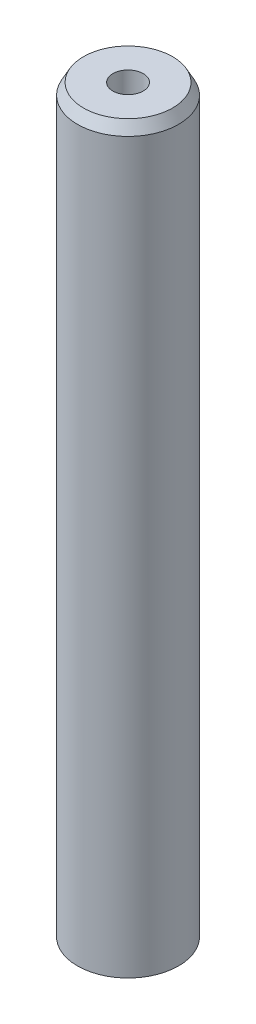
ISO-10303-21;
HEADER;
FILE_DESCRIPTION(('STEP AP214'),'2;1');
FILE_NAME('part.step','',(''),(''),'','','');
FILE_SCHEMA(('AUTOMOTIVE_DESIGN { 1 0 10303 214 1 1 1 1 }'));
ENDSEC;
DATA;
#1=APPLICATION_CONTEXT('core data for automotive mechanical design processes');
#2=APPLICATION_PROTOCOL_DEFINITION('international standard','automotive_design',2000,#1);
#3=PRODUCT_CONTEXT('',#1,'mechanical');
#4=PRODUCT('Part','Part','',(#3));
#5=PRODUCT_RELATED_PRODUCT_CATEGORY('part','',(#4));
#6=PRODUCT_DEFINITION_FORMATION('','',#4);
#7=PRODUCT_DEFINITION_CONTEXT('part definition',#1,'design');
#8=PRODUCT_DEFINITION('design','',#6,#7);
#9=PRODUCT_DEFINITION_SHAPE('','',#8);
#10=(LENGTH_UNIT() NAMED_UNIT(*) SI_UNIT(.MILLI.,.METRE.));
#11=(NAMED_UNIT(*) PLANE_ANGLE_UNIT() SI_UNIT($,.RADIAN.));
#12=(NAMED_UNIT(*) SI_UNIT($,.STERADIAN.) SOLID_ANGLE_UNIT());
#13=UNCERTAINTY_MEASURE_WITH_UNIT(LENGTH_MEASURE(1.E-05),#10,'distance_accuracy_value','');
#14=(GEOMETRIC_REPRESENTATION_CONTEXT(3) GLOBAL_UNCERTAINTY_ASSIGNED_CONTEXT((#13)) GLOBAL_UNIT_ASSIGNED_CONTEXT((#10,
#11,#12)) REPRESENTATION_CONTEXT('',''));
#15=CARTESIAN_POINT('',(0.,0.,0.));
#16=DIRECTION('',(0.,0.,1.));
#17=DIRECTION('',(1.,0.,0.));
#18=AXIS2_PLACEMENT_3D('',#15,#16,#17);
#19=CARTESIAN_POINT('',(0.,73.7592737962187,0.));
#20=DIRECTION('',(0.,-1.,0.));
#21=DIRECTION('',(0.,0.,-1.));
#22=AXIS2_PLACEMENT_3D('',#19,#20,#21);
#23=CYLINDRICAL_SURFACE('',#22,5.);
#24=CARTESIAN_POINT('',(0.,72.6596073131407,0.));
#25=DIRECTION('',(0.,1.,0.));
#26=DIRECTION('',(0.,0.,1.));
#27=AXIS2_PLACEMENT_3D('',#24,#25,#26);
#28=CIRCLE('',#27,5.);
#29=CARTESIAN_POINT('',(0.,72.6596073131407,-5.));
#30=VERTEX_POINT('',#29);
#31=EDGE_CURVE('E50',#30,#30,#28,.F.);
#32=ORIENTED_EDGE('',*,*,#31,.T.);
#33=EDGE_LOOP('',(#32));
#34=FACE_BOUND('',#33,.T.);
#35=CARTESIAN_POINT('',(0.,0.596093347788318,0.));
#36=DIRECTION('',(0.,1.,0.));
#37=DIRECTION('',(0.,0.,1.));
#38=AXIS2_PLACEMENT_3D('',#35,#36,#37);
#39=CIRCLE('',#38,5.);
#40=CARTESIAN_POINT('',(0.,0.596093347788318,5.));
#41=VERTEX_POINT('',#40);
#42=EDGE_CURVE('E51',#41,#41,#39,.T.);
#43=ORIENTED_EDGE('',*,*,#42,.T.);
#44=EDGE_LOOP('',(#43));
#45=FACE_BOUND('',#44,.T.);
#46=ADVANCED_FACE('F39',(#34,#45),#23,.T.);
#47=CARTESIAN_POINT('',(0.,73.7592737962187,0.));
#48=DIRECTION('',(0.,1.,0.));
#49=DIRECTION('',(0.,0.,1.));
#50=AXIS2_PLACEMENT_3D('',#47,#48,#49);
#51=PLANE('',#50);
#52=CARTESIAN_POINT('',(0.,73.7592737962187,0.));
#53=DIRECTION('',(0.,1.,0.));
#54=DIRECTION('',(0.,0.,1.));
#55=AXIS2_PLACEMENT_3D('',#52,#53,#54);
#56=CIRCLE('',#55,4.40390665221171);
#57=CARTESIAN_POINT('',(0.,73.7592737962187,-4.40390665221171));
#58=VERTEX_POINT('',#57);
#59=EDGE_CURVE('E54',#58,#58,#56,.T.);
#60=ORIENTED_EDGE('',*,*,#59,.T.);
#61=EDGE_LOOP('',(#60));
#62=FACE_BOUND('',#61,.T.);
#63=CARTESIAN_POINT('',(0.,73.7592737962187,0.));
#64=DIRECTION('',(0.,1.,0.));
#65=DIRECTION('',(0.,0.,1.));
#66=AXIS2_PLACEMENT_3D('',#63,#64,#65);
#67=CIRCLE('',#66,1.49879697790066);
#68=CARTESIAN_POINT('',(0.,73.7592737962187,1.49879697790066));
#69=VERTEX_POINT('',#68);
#70=EDGE_CURVE('E58',#69,#69,#67,.T.);
#71=ORIENTED_EDGE('',*,*,#70,.F.);
#72=EDGE_LOOP('',(#71));
#73=FACE_BOUND('',#72,.T.);
#74=ADVANCED_FACE('F69',(#62,#73),#51,.T.);
#75=CARTESIAN_POINT('',(0.,0.,0.));
#76=DIRECTION('',(0.,1.,0.));
#77=DIRECTION('',(0.,0.,1.));
#78=AXIS2_PLACEMENT_3D('',#75,#76,#77);
#79=PLANE('',#78);
#80=CARTESIAN_POINT('',(0.,0.,0.));
#81=DIRECTION('',(0.,1.,0.));
#82=DIRECTION('',(0.,0.,1.));
#83=AXIS2_PLACEMENT_3D('',#80,#81,#82);
#84=CIRCLE('',#83,3.90033351692198);
#85=CARTESIAN_POINT('',(0.,0.,3.90033351692198));
#86=VERTEX_POINT('',#85);
#87=EDGE_CURVE('E10',#86,#86,#84,.F.);
#88=ORIENTED_EDGE('',*,*,#87,.T.);
#89=EDGE_LOOP('',(#88));
#90=FACE_BOUND('',#89,.T.);
#91=CARTESIAN_POINT('',(0.,0.,0.));
#92=DIRECTION('',(0.,1.,0.));
#93=DIRECTION('',(0.,0.,1.));
#94=AXIS2_PLACEMENT_3D('',#91,#92,#93);
#95=CIRCLE('',#94,1.49879697790066);
#96=CARTESIAN_POINT('',(0.,0.,1.49879697790066));
#97=VERTEX_POINT('',#96);
#98=EDGE_CURVE('E63',#97,#97,#95,.T.);
#99=ORIENTED_EDGE('',*,*,#98,.T.);
#100=EDGE_LOOP('',(#99));
#101=FACE_BOUND('',#100,.T.);
#102=ADVANCED_FACE('F75',(#90,#101),#79,.F.);
#103=CARTESIAN_POINT('',(0.,73.7592737962187,0.));
#104=DIRECTION('',(0.,-1.,0.));
#105=DIRECTION('',(0.,0.,-1.));
#106=AXIS2_PLACEMENT_3D('',#103,#104,#105);
#107=CYLINDRICAL_SURFACE('',#106,1.49879697790066);
#108=ORIENTED_EDGE('',*,*,#70,.T.);
#109=EDGE_LOOP('',(#108));
#110=FACE_BOUND('',#109,.T.);
#111=ORIENTED_EDGE('',*,*,#98,.F.);
#112=EDGE_LOOP('',(#111));
#113=FACE_BOUND('',#112,.T.);
#114=ADVANCED_FACE('F70',(#110,#113),#107,.F.);
#115=CARTESIAN_POINT('',(0.,73.7592737962187,0.));
#116=DIRECTION('',(0.,-1.,0.));
#117=DIRECTION('',(0.,0.,-1.));
#118=AXIS2_PLACEMENT_3D('',#115,#116,#117);
#119=CONICAL_SURFACE('',#118,4.40390665221171,0.49673252762909);
#120=CARTESIAN_POINT('',(0.,72.6596073131407,-5.));
#121=CARTESIAN_POINT('',(0.,72.6710621723394,-4.99379069429387));
#122=CARTESIAN_POINT('',(0.,72.6825170315381,-4.98758138858775));
#123=CARTESIAN_POINT('',(0.,72.7054267499356,-4.97516277717549));
#124=CARTESIAN_POINT('',(0.,72.7168816091343,-4.96895347146936));
#125=CARTESIAN_POINT('',(0.,72.7397913275318,-4.95653486005711));
#126=CARTESIAN_POINT('',(0.,72.7512461867305,-4.95032555435098));
#127=CARTESIAN_POINT('',(0.,72.774155905128,-4.93790694293872));
#128=CARTESIAN_POINT('',(0.,72.7856107643267,-4.9316976372326));
#129=CARTESIAN_POINT('',(0.,72.8085204827241,-4.91927902582034));
#130=CARTESIAN_POINT('',(0.,72.8199753419229,-4.91306972011421));
#131=CARTESIAN_POINT('',(0.,72.8428850603203,-4.90065110870195));
#132=CARTESIAN_POINT('',(0.,72.8543399195191,-4.89444180299583));
#133=CARTESIAN_POINT('',(0.,72.8772496379165,-4.88202319158357));
#134=CARTESIAN_POINT('',(0.,72.8887044971153,-4.87581388587744));
#135=CARTESIAN_POINT('',(0.,72.9116142155127,-4.86339527446519));
#136=CARTESIAN_POINT('',(0.,72.9230690747114,-4.85718596875906));
#137=CARTESIAN_POINT('',(0.,72.9459787931089,-4.8447673573468));
#138=CARTESIAN_POINT('',(0.,72.9574336523076,-4.83855805164067));
#139=CARTESIAN_POINT('',(0.,72.9803433707051,-4.82613944022842));
#140=CARTESIAN_POINT('',(0.,72.9917982299038,-4.81993013452229));
#141=CARTESIAN_POINT('',(0.,73.0147079483013,-4.80751152311003));
#142=CARTESIAN_POINT('',(0.,73.0261628075,-4.80130221740391));
#143=CARTESIAN_POINT('',(0.,73.0490725258975,-4.78888360599165));
#144=CARTESIAN_POINT('',(0.,73.0605273850962,-4.78267430028552));
#145=CARTESIAN_POINT('',(0.,73.0834371034937,-4.77025568887327));
#146=CARTESIAN_POINT('',(0.,73.0948919626924,-4.76404638316714));
#147=CARTESIAN_POINT('',(0.,73.1178016810898,-4.75162777175488));
#148=CARTESIAN_POINT('',(0.,73.1292565402886,-4.74541846604875));
#149=CARTESIAN_POINT('',(0.,73.152166258686,-4.7329998546365));
#150=CARTESIAN_POINT('',(0.,73.1636211178847,-4.72679054893037));
#151=CARTESIAN_POINT('',(0.,73.1865308362822,-4.71437193751811));
#152=CARTESIAN_POINT('',(0.,73.1979856954809,-4.70816263181199));
#153=CARTESIAN_POINT('',(0.,73.2208954138784,-4.69574402039973));
#154=CARTESIAN_POINT('',(0.,73.2323502730771,-4.6895347146936));
#155=CARTESIAN_POINT('',(0.,73.2552599914746,-4.67711610328135));
#156=CARTESIAN_POINT('',(0.,73.2667148506733,-4.67090679757522));
#157=CARTESIAN_POINT('',(0.,73.2896245690708,-4.65848818616296));
#158=CARTESIAN_POINT('',(0.,73.3010794282695,-4.65227888045683));
#159=CARTESIAN_POINT('',(0.,73.3239891466669,-4.63986026904458));
#160=CARTESIAN_POINT('',(0.,73.3354440058657,-4.63365096333845));
#161=CARTESIAN_POINT('',(0.,73.3583537242631,-4.62123235192619));
#162=CARTESIAN_POINT('',(0.,73.3698085834619,-4.61502304622006));
#163=CARTESIAN_POINT('',(0.,73.3927183018593,-4.60260443480781));
#164=CARTESIAN_POINT('',(0.,73.404173161058,-4.59639512910168));
#165=CARTESIAN_POINT('',(0.,73.4270828794555,-4.58397651768942));
#166=CARTESIAN_POINT('',(0.,73.4385377386542,-4.5777672119833));
#167=CARTESIAN_POINT('',(0.,73.4614474570517,-4.56534860057104));
#168=CARTESIAN_POINT('',(0.,73.4729023162504,-4.55913929486491));
#169=CARTESIAN_POINT('',(0.,73.4958120346479,-4.54672068345266));
#170=CARTESIAN_POINT('',(0.,73.5072668938466,-4.54051137774653));
#171=CARTESIAN_POINT('',(0.,73.5301766122441,-4.52809276633427));
#172=CARTESIAN_POINT('',(0.,73.5416314714428,-4.52188346062814));
#173=CARTESIAN_POINT('',(0.,73.5645411898403,-4.50946484921589));
#174=CARTESIAN_POINT('',(0.,73.575996049039,-4.50325554350976));
#175=CARTESIAN_POINT('',(0.,73.5989057674364,-4.4908369320975));
#176=CARTESIAN_POINT('',(0.,73.6103606266352,-4.48462762639138));
#177=CARTESIAN_POINT('',(0.,73.6332703450326,-4.47220901497912));
#178=CARTESIAN_POINT('',(0.,73.6447252042313,-4.46599970927299));
#179=CARTESIAN_POINT('',(0.,73.6676349226288,-4.45358109786074));
#180=CARTESIAN_POINT('',(0.,73.6790897818275,-4.44737179215461));
#181=CARTESIAN_POINT('',(0.,73.701999500225,-4.43495318074235));
#182=CARTESIAN_POINT('',(0.,73.7134543594237,-4.42874387503622));
#183=CARTESIAN_POINT('',(0.,73.7363640778212,-4.41632526362397));
#184=CARTESIAN_POINT('',(0.,73.7478189370199,-4.41011595791784));
#185=CARTESIAN_POINT('',(0.,73.7592737962187,-4.40390665221171));
#186=B_SPLINE_CURVE_WITH_KNOTS('',3,(#120,#121,#122,#123,#124,#125,#126,#127,#128,#129,#130,
#131,#132,#133,#134,#135,#136,#137,#138,#139,#140,#141,#142,#143,#144,#145,#146,#147,#148,#149,
#150,#151,#152,#153,#154,#155,#156,#157,#158,#159,#160,#161,#162,#163,#164,#165,#166,#167,#168,
#169,#170,#171,#172,#173,#174,#175,#176,#177,#178,#179,#180,#181,#182,#183,#184,#185),
.UNSPECIFIED.,.F.,.F.,(4,2,2,2,2,2,2,2,2,2,2,2,2,2,2,2,2,2,2,2,2,2,2,2,2,2,2,2,2,2,2,2,4),(0.,
0.0390886619051212,0.0781773238102545,0.117265985715388,0.156354647620521,0.195443309525655,
0.234531971430788,0.273620633335921,0.312709295241055,0.351797957146176,0.39088661905131,
0.429975280956443,0.469063942861576,0.50815260476671,0.547241266671843,0.586329928576976,
0.62541859048211,0.664507252387231,0.703595914292364,0.742684576197498,0.781773238102631,
0.820861900007765,0.859950561912898,0.899039223818031,0.938127885723165,0.977216547628286,
1.01630520953342,1.05539387143855,1.09448253334369,1.13357119524882,1.17265985715395,
1.21174851905909,1.25083718096422),.UNSPECIFIED.);
#187=EDGE_CURVE('BSEAM81',#30,#58,#186,.T.);
#188=ORIENTED_EDGE('',*,*,#31,.F.);
#189=ORIENTED_EDGE('',*,*,#59,.F.);
#190=ORIENTED_EDGE('',*,*,#187,.T.);
#191=ORIENTED_EDGE('',*,*,#187,.F.);
#192=EDGE_LOOP('',(#188,#190,#189,#191));
#193=FACE_BOUND('',#192,.T.);
#194=ADVANCED_FACE('F81',(#193),#119,.T.);
#195=CARTESIAN_POINT('',(0.,0.596093347788318,0.));
#196=DIRECTION('',(0.,1.,0.));
#197=DIRECTION('',(0.,0.,1.));
#198=AXIS2_PLACEMENT_3D('',#195,#196,#197);
#199=CONICAL_SURFACE('',#198,5.,1.07406379916581);
#200=ORIENTED_EDGE('',*,*,#87,.F.);
#201=EDGE_LOOP('',(#200));
#202=FACE_BOUND('',#201,.T.);
#203=ORIENTED_EDGE('',*,*,#42,.F.);
#204=EDGE_LOOP('',(#203));
#205=FACE_BOUND('',#204,.T.);
#206=ADVANCED_FACE('F45',(#202,#205),#199,.T.);
#207=CLOSED_SHELL('',(#46,#74,#102,#114,#194,#206));
#208=MANIFOLD_SOLID_BREP('B2',#207);
#209=ADVANCED_BREP_SHAPE_REPRESENTATION('',(#18,#208),#14);
#210=SHAPE_DEFINITION_REPRESENTATION(#9,#209);
ENDSEC;
END-ISO-10303-21;
